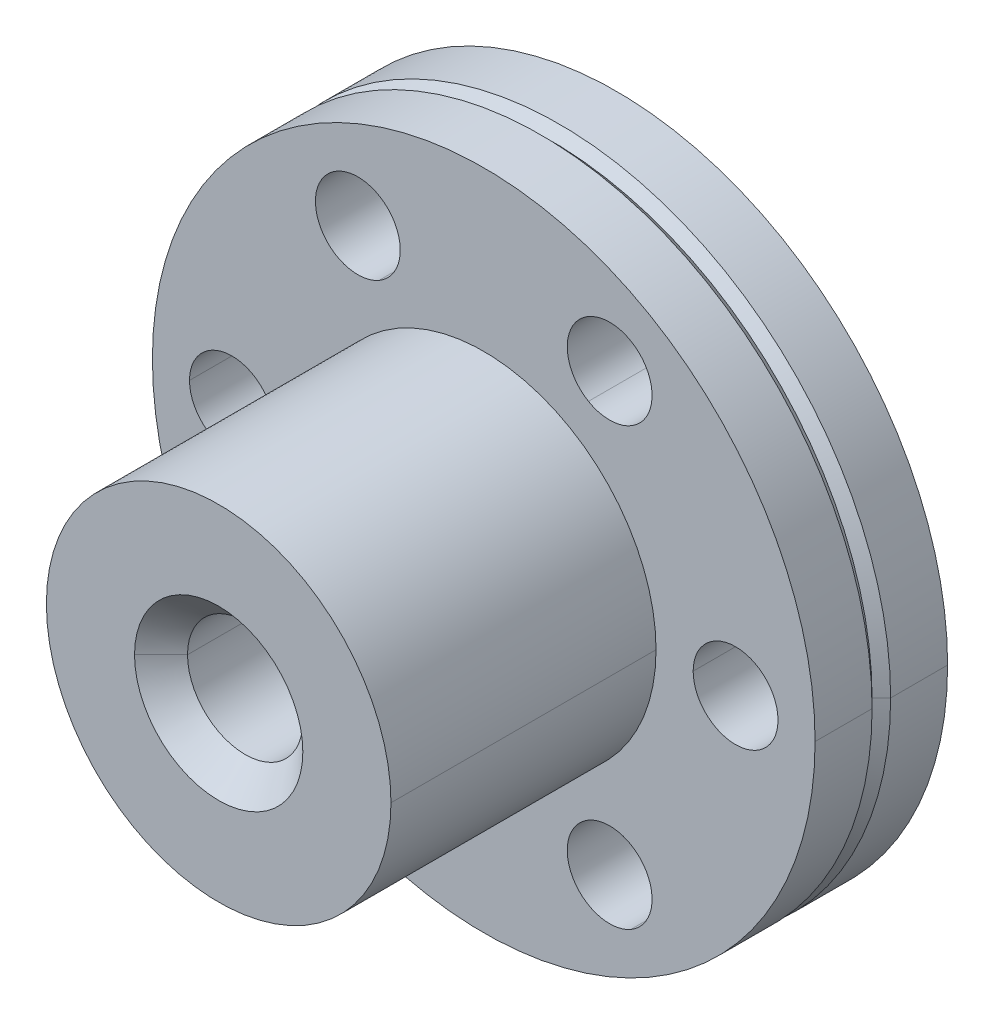
ISO-10303-21;
HEADER;
FILE_DESCRIPTION(('STEP AP214'),'2;1');
FILE_NAME('part.step','',(''),(''),'','','');
FILE_SCHEMA(('AUTOMOTIVE_DESIGN { 1 0 10303 214 1 1 1 1 }'));
ENDSEC;
DATA;
#1=APPLICATION_CONTEXT('core data for automotive mechanical design processes');
#2=APPLICATION_PROTOCOL_DEFINITION('international standard','automotive_design',2000,#1);
#3=PRODUCT_CONTEXT('',#1,'mechanical');
#4=PRODUCT('Part','Part','',(#3));
#5=PRODUCT_RELATED_PRODUCT_CATEGORY('part','',(#4));
#6=PRODUCT_DEFINITION_FORMATION('','',#4);
#7=PRODUCT_DEFINITION_CONTEXT('part definition',#1,'design');
#8=PRODUCT_DEFINITION('design','',#6,#7);
#9=PRODUCT_DEFINITION_SHAPE('','',#8);
#10=(LENGTH_UNIT() NAMED_UNIT(*) SI_UNIT(.MILLI.,.METRE.));
#11=(NAMED_UNIT(*) PLANE_ANGLE_UNIT() SI_UNIT($,.RADIAN.));
#12=(NAMED_UNIT(*) SI_UNIT($,.STERADIAN.) SOLID_ANGLE_UNIT());
#13=UNCERTAINTY_MEASURE_WITH_UNIT(LENGTH_MEASURE(1.E-05),#10,'distance_accuracy_value','');
#14=(GEOMETRIC_REPRESENTATION_CONTEXT(3) GLOBAL_UNCERTAINTY_ASSIGNED_CONTEXT((#13)) GLOBAL_UNIT_ASSIGNED_CONTEXT((#10,
#11,#12)) REPRESENTATION_CONTEXT('',''));
#15=CARTESIAN_POINT('',(0.,0.,0.));
#16=DIRECTION('',(0.,0.,1.));
#17=DIRECTION('',(1.,0.,0.));
#18=AXIS2_PLACEMENT_3D('',#15,#16,#17);
#19=CARTESIAN_POINT('',(0.,0.,0.5));
#20=DIRECTION('',(0.,0.,-1.));
#21=DIRECTION('',(1.,0.,0.));
#22=AXIS2_PLACEMENT_3D('',#19,#20,#21);
#23=CONICAL_SURFACE('',#22,2.675,0.785398163397448);
#24=DIRECTION('',(0.707106781186548,0.,-0.707106781186548));
#25=VECTOR('',#24,1.);
#26=CARTESIAN_POINT('',(2.675,0.,0.5));
#27=LINE('',#26,#25);
#28=CARTESIAN_POINT('',(2.175,0.,1.));
#29=VERTEX_POINT('',#28);
#30=CARTESIAN_POINT('',(3.175,0.,0.));
#31=VERTEX_POINT('',#30);
#32=EDGE_CURVE('E193',#29,#31,#27,.T.);
#33=ORIENTED_EDGE('',*,*,#32,.T.);
#34=CARTESIAN_POINT('',(0.,0.,0.));
#35=DIRECTION('',(0.,0.,-1.));
#36=DIRECTION('',(1.,0.,0.));
#37=AXIS2_PLACEMENT_3D('',#34,#35,#36);
#38=CIRCLE('',#37,3.175);
#39=CARTESIAN_POINT('',(-3.175,0.,0.));
#40=VERTEX_POINT('',#39);
#41=EDGE_CURVE('E9',#31,#40,#38,.T.);
#42=ORIENTED_EDGE('',*,*,#41,.T.);
#43=DIRECTION('',(0.707106781186548,0.,0.707106781186548));
#44=VECTOR('',#43,1.);
#45=CARTESIAN_POINT('',(-2.675,0.,0.5));
#46=LINE('',#45,#44);
#47=CARTESIAN_POINT('',(-2.175,0.,1.));
#48=VERTEX_POINT('',#47);
#49=EDGE_CURVE('E208',#40,#48,#46,.T.);
#50=ORIENTED_EDGE('',*,*,#49,.T.);
#51=CARTESIAN_POINT('',(0.,0.,1.));
#52=DIRECTION('',(0.,0.,-1.));
#53=DIRECTION('',(1.,0.,0.));
#54=AXIS2_PLACEMENT_3D('',#51,#52,#53);
#55=CIRCLE('',#54,2.175);
#56=EDGE_CURVE('E238',#29,#48,#55,.T.);
#57=ORIENTED_EDGE('',*,*,#56,.F.);
#58=EDGE_LOOP('',(#33,#42,#50,#57));
#59=FACE_BOUND('',#58,.T.);
#60=ADVANCED_FACE('F15',(#59),#23,.F.);
#61=CARTESIAN_POINT('',(7.8375,0.,0.));
#62=DIRECTION('',(0.,0.,-1.));
#63=DIRECTION('',(0.,-1.,0.));
#64=AXIS2_PLACEMENT_3D('',#61,#62,#63);
#65=PLANE('',#64);
#66=ORIENTED_EDGE('',*,*,#41,.F.);
#67=CARTESIAN_POINT('',(0.,0.,0.));
#68=DIRECTION('',(0.,0.,-1.));
#69=DIRECTION('',(1.,0.,0.));
#70=AXIS2_PLACEMENT_3D('',#67,#68,#69);
#71=CIRCLE('',#70,3.175);
#72=EDGE_CURVE('E217',#40,#31,#71,.T.);
#73=ORIENTED_EDGE('',*,*,#72,.F.);
#74=EDGE_LOOP('',(#66,#73));
#75=FACE_BOUND('',#74,.T.);
#76=CARTESIAN_POINT('',(9.5,0.,0.));
#77=DIRECTION('',(0.,0.,1.));
#78=DIRECTION('',(1.,0.,0.));
#79=AXIS2_PLACEMENT_3D('',#76,#77,#78);
#80=CIRCLE('',#79,1.6);
#81=CARTESIAN_POINT('',(11.1,0.,0.));
#82=VERTEX_POINT('',#81);
#83=CARTESIAN_POINT('',(7.9,0.,0.));
#84=VERTEX_POINT('',#83);
#85=EDGE_CURVE('E178',#82,#84,#80,.T.);
#86=ORIENTED_EDGE('',*,*,#85,.T.);
#87=CARTESIAN_POINT('',(9.5,0.,0.));
#88=DIRECTION('',(0.,0.,1.));
#89=DIRECTION('',(1.,0.,0.));
#90=AXIS2_PLACEMENT_3D('',#87,#88,#89);
#91=CIRCLE('',#90,1.6);
#92=EDGE_CURVE('E189',#84,#82,#91,.T.);
#93=ORIENTED_EDGE('',*,*,#92,.T.);
#94=EDGE_LOOP('',(#86,#93));
#95=FACE_BOUND('',#94,.T.);
#96=CARTESIAN_POINT('',(4.75,8.227241336,0.));
#97=DIRECTION('',(0.,0.,1.));
#98=DIRECTION('',(0.499999999993262,0.866025403788329,0.));
#99=AXIS2_PLACEMENT_3D('',#96,#97,#98);
#100=CIRCLE('',#99,1.60000000002156);
#101=CARTESIAN_POINT('',(5.55,9.61288198208,0.));
#102=VERTEX_POINT('',#101);
#103=CARTESIAN_POINT('',(3.95,6.84160068992,0.));
#104=VERTEX_POINT('',#103);
#105=EDGE_CURVE('E179',#102,#104,#100,.T.);
#106=ORIENTED_EDGE('',*,*,#105,.T.);
#107=CARTESIAN_POINT('',(4.75,8.227241336,0.));
#108=DIRECTION('',(0.,0.,1.));
#109=DIRECTION('',(0.499999999993262,0.866025403788329,0.));
#110=AXIS2_PLACEMENT_3D('',#107,#108,#109);
#111=CIRCLE('',#110,1.60000000002156);
#112=EDGE_CURVE('E214',#104,#102,#111,.T.);
#113=ORIENTED_EDGE('',*,*,#112,.T.);
#114=EDGE_LOOP('',(#106,#113));
#115=FACE_BOUND('',#114,.T.);
#116=CARTESIAN_POINT('',(-4.75,8.227241336,0.));
#117=DIRECTION('',(0.,0.,1.));
#118=DIRECTION('',(-0.499999999993262,0.866025403788329,0.));
#119=AXIS2_PLACEMENT_3D('',#116,#117,#118);
#120=CIRCLE('',#119,1.60000000002156);
#121=CARTESIAN_POINT('',(-5.55,9.61288198208,0.));
#122=VERTEX_POINT('',#121);
#123=CARTESIAN_POINT('',(-3.95,6.84160068992,0.));
#124=VERTEX_POINT('',#123);
#125=EDGE_CURVE('E227',#122,#124,#120,.T.);
#126=ORIENTED_EDGE('',*,*,#125,.T.);
#127=CARTESIAN_POINT('',(-4.75,8.227241336,0.));
#128=DIRECTION('',(0.,0.,1.));
#129=DIRECTION('',(-0.499999999993262,0.866025403788329,0.));
#130=AXIS2_PLACEMENT_3D('',#127,#128,#129);
#131=CIRCLE('',#130,1.60000000002156);
#132=EDGE_CURVE('E245',#124,#122,#131,.T.);
#133=ORIENTED_EDGE('',*,*,#132,.T.);
#134=EDGE_LOOP('',(#126,#133));
#135=FACE_BOUND('',#134,.T.);
#136=CARTESIAN_POINT('',(-9.5,0.,0.));
#137=DIRECTION('',(0.,0.,1.));
#138=DIRECTION('',(-1.,0.,0.));
#139=AXIS2_PLACEMENT_3D('',#136,#137,#138);
#140=CIRCLE('',#139,1.6);
#141=CARTESIAN_POINT('',(-11.1,0.,0.));
#142=VERTEX_POINT('',#141);
#143=CARTESIAN_POINT('',(-7.9,0.,0.));
#144=VERTEX_POINT('',#143);
#145=EDGE_CURVE('E319',#142,#144,#140,.T.);
#146=ORIENTED_EDGE('',*,*,#145,.T.);
#147=CARTESIAN_POINT('',(-9.5,0.,0.));
#148=DIRECTION('',(0.,0.,1.));
#149=DIRECTION('',(-1.,0.,0.));
#150=AXIS2_PLACEMENT_3D('',#147,#148,#149);
#151=CIRCLE('',#150,1.6);
#152=EDGE_CURVE('E334',#144,#142,#151,.T.);
#153=ORIENTED_EDGE('',*,*,#152,.T.);
#154=EDGE_LOOP('',(#146,#153));
#155=FACE_BOUND('',#154,.T.);
#156=CARTESIAN_POINT('',(-4.75,-8.227241336,0.));
#157=DIRECTION('',(0.,0.,1.));
#158=DIRECTION('',(-0.499999999993262,-0.866025403788329,0.));
#159=AXIS2_PLACEMENT_3D('',#156,#157,#158);
#160=CIRCLE('',#159,1.60000000002156);
#161=CARTESIAN_POINT('',(-5.55,-9.61288198208,0.));
#162=VERTEX_POINT('',#161);
#163=CARTESIAN_POINT('',(-3.95,-6.84160068992,0.));
#164=VERTEX_POINT('',#163);
#165=EDGE_CURVE('E309',#162,#164,#160,.T.);
#166=ORIENTED_EDGE('',*,*,#165,.T.);
#167=CARTESIAN_POINT('',(-4.75,-8.227241336,0.));
#168=DIRECTION('',(0.,0.,1.));
#169=DIRECTION('',(-0.499999999993262,-0.866025403788329,0.));
#170=AXIS2_PLACEMENT_3D('',#167,#168,#169);
#171=CIRCLE('',#170,1.60000000002156);
#172=EDGE_CURVE('E265',#164,#162,#171,.T.);
#173=ORIENTED_EDGE('',*,*,#172,.T.);
#174=EDGE_LOOP('',(#166,#173));
#175=FACE_BOUND('',#174,.T.);
#176=CARTESIAN_POINT('',(4.75,-8.227241336,0.));
#177=DIRECTION('',(0.,0.,1.));
#178=DIRECTION('',(0.499999999993261,-0.866025403788329,0.));
#179=AXIS2_PLACEMENT_3D('',#176,#177,#178);
#180=CIRCLE('',#179,1.60000000002156);
#181=CARTESIAN_POINT('',(5.55,-9.61288198208,0.));
#182=VERTEX_POINT('',#181);
#183=CARTESIAN_POINT('',(3.95,-6.84160068992,0.));
#184=VERTEX_POINT('',#183);
#185=EDGE_CURVE('E36',#182,#184,#180,.T.);
#186=ORIENTED_EDGE('',*,*,#185,.T.);
#187=CARTESIAN_POINT('',(4.75,-8.227241336,0.));
#188=DIRECTION('',(0.,0.,1.));
#189=DIRECTION('',(0.499999999993261,-0.866025403788329,0.));
#190=AXIS2_PLACEMENT_3D('',#187,#188,#189);
#191=CIRCLE('',#190,1.60000000002156);
#192=EDGE_CURVE('E275',#184,#182,#191,.T.);
#193=ORIENTED_EDGE('',*,*,#192,.T.);
#194=EDGE_LOOP('',(#186,#193));
#195=FACE_BOUND('',#194,.T.);
#196=CARTESIAN_POINT('',(0.,0.,0.));
#197=DIRECTION('',(0.,0.,-1.));
#198=DIRECTION('',(1.,0.,0.));
#199=AXIS2_PLACEMENT_3D('',#196,#197,#198);
#200=CIRCLE('',#199,12.5);
#201=CARTESIAN_POINT('',(12.5,0.,0.));
#202=VERTEX_POINT('',#201);
#203=CARTESIAN_POINT('',(-12.5,0.,0.));
#204=VERTEX_POINT('',#203);
#205=EDGE_CURVE('E248',#202,#204,#200,.T.);
#206=ORIENTED_EDGE('',*,*,#205,.T.);
#207=CARTESIAN_POINT('',(0.,0.,0.));
#208=DIRECTION('',(0.,0.,-1.));
#209=DIRECTION('',(1.,0.,0.));
#210=AXIS2_PLACEMENT_3D('',#207,#208,#209);
#211=CIRCLE('',#210,12.5);
#212=EDGE_CURVE('E22',#204,#202,#211,.T.);
#213=ORIENTED_EDGE('',*,*,#212,.T.);
#214=EDGE_LOOP('',(#206,#213));
#215=FACE_BOUND('',#214,.T.);
#216=ADVANCED_FACE('F367',(#75,#95,#115,#135,#155,#175,#195,#215),#65,.T.);
#217=CARTESIAN_POINT('',(0.,0.,1.075));
#218=DIRECTION('',(0.,0.,-1.));
#219=DIRECTION('',(1.,0.,0.));
#220=AXIS2_PLACEMENT_3D('',#217,#218,#219);
#221=CYLINDRICAL_SURFACE('',#220,12.5);
#222=DIRECTION('',(0.,0.,-1.));
#223=VECTOR('',#222,1.);
#224=CARTESIAN_POINT('',(12.5,0.,1.075));
#225=LINE('',#224,#223);
#226=CARTESIAN_POINT('',(12.5,0.,2.15));
#227=VERTEX_POINT('',#226);
#228=EDGE_CURVE('E220',#227,#202,#225,.T.);
#229=ORIENTED_EDGE('',*,*,#228,.T.);
#230=ORIENTED_EDGE('',*,*,#212,.F.);
#231=DIRECTION('',(0.,0.,1.));
#232=VECTOR('',#231,1.);
#233=CARTESIAN_POINT('',(-12.5,0.,1.075));
#234=LINE('',#233,#232);
#235=CARTESIAN_POINT('',(-12.5,0.,2.15));
#236=VERTEX_POINT('',#235);
#237=EDGE_CURVE('E241',#204,#236,#234,.T.);
#238=ORIENTED_EDGE('',*,*,#237,.T.);
#239=CARTESIAN_POINT('',(0.,0.,2.15));
#240=DIRECTION('',(0.,0.,-1.));
#241=DIRECTION('',(1.,0.,0.));
#242=AXIS2_PLACEMENT_3D('',#239,#240,#241);
#243=CIRCLE('',#242,12.5);
#244=EDGE_CURVE('E199',#236,#227,#243,.T.);
#245=ORIENTED_EDGE('',*,*,#244,.T.);
#246=EDGE_LOOP('',(#229,#230,#238,#245));
#247=FACE_BOUND('',#246,.T.);
#248=ADVANCED_FACE('F373',(#247),#221,.T.);
#249=CARTESIAN_POINT('',(0.,0.,2.325));
#250=DIRECTION('',(0.,0.,-1.));
#251=DIRECTION('',(1.,0.,0.));
#252=AXIS2_PLACEMENT_3D('',#249,#250,#251);
#253=CONICAL_SURFACE('',#252,12.325,0.785398163397448);
#254=DIRECTION('',(0.707106781186547,0.,-0.707106781186548));
#255=VECTOR('',#254,1.);
#256=CARTESIAN_POINT('',(12.325,0.,2.325));
#257=LINE('',#256,#255);
#258=CARTESIAN_POINT('',(12.15,0.,2.5));
#259=VERTEX_POINT('',#258);
#260=EDGE_CURVE('E251',#259,#227,#257,.T.);
#261=ORIENTED_EDGE('',*,*,#260,.T.);
#262=ORIENTED_EDGE('',*,*,#244,.F.);
#263=DIRECTION('',(0.707106781186547,0.,0.707106781186548));
#264=VECTOR('',#263,1.);
#265=CARTESIAN_POINT('',(-12.325,0.,2.325));
#266=LINE('',#265,#264);
#267=CARTESIAN_POINT('',(-12.15,0.,2.5));
#268=VERTEX_POINT('',#267);
#269=EDGE_CURVE('E257',#236,#268,#266,.T.);
#270=ORIENTED_EDGE('',*,*,#269,.T.);
#271=CARTESIAN_POINT('',(0.,0.,2.5));
#272=DIRECTION('',(0.,0.,-1.));
#273=DIRECTION('',(1.,0.,0.));
#274=AXIS2_PLACEMENT_3D('',#271,#272,#273);
#275=CIRCLE('',#274,12.15);
#276=EDGE_CURVE('E197',#268,#259,#275,.T.);
#277=ORIENTED_EDGE('',*,*,#276,.T.);
#278=EDGE_LOOP('',(#261,#262,#270,#277));
#279=FACE_BOUND('',#278,.T.);
#280=ADVANCED_FACE('F378',(#279),#253,.T.);
#281=CARTESIAN_POINT('',(0.,0.,2.675));
#282=DIRECTION('',(0.,0.,1.));
#283=DIRECTION('',(1.,0.,0.));
#284=AXIS2_PLACEMENT_3D('',#281,#282,#283);
#285=CONICAL_SURFACE('',#284,12.325,0.785398163397448);
#286=DIRECTION('',(-0.707106781186547,0.,-0.707106781186548));
#287=VECTOR('',#286,1.);
#288=CARTESIAN_POINT('',(12.325,0.,2.675));
#289=LINE('',#288,#287);
#290=CARTESIAN_POINT('',(12.5,0.,2.85));
#291=VERTEX_POINT('',#290);
#292=EDGE_CURVE('E205',#291,#259,#289,.T.);
#293=ORIENTED_EDGE('',*,*,#292,.T.);
#294=ORIENTED_EDGE('',*,*,#276,.F.);
#295=DIRECTION('',(-0.707106781186547,0.,0.707106781186548));
#296=VECTOR('',#295,1.);
#297=CARTESIAN_POINT('',(-12.325,0.,2.675));
#298=LINE('',#297,#296);
#299=CARTESIAN_POINT('',(-12.5,0.,2.85));
#300=VERTEX_POINT('',#299);
#301=EDGE_CURVE('E204',#268,#300,#298,.T.);
#302=ORIENTED_EDGE('',*,*,#301,.T.);
#303=CARTESIAN_POINT('',(0.,0.,2.85));
#304=DIRECTION('',(0.,0.,-1.));
#305=DIRECTION('',(1.,0.,0.));
#306=AXIS2_PLACEMENT_3D('',#303,#304,#305);
#307=CIRCLE('',#306,12.5);
#308=EDGE_CURVE('E200',#300,#291,#307,.T.);
#309=ORIENTED_EDGE('',*,*,#308,.T.);
#310=EDGE_LOOP('',(#293,#294,#302,#309));
#311=FACE_BOUND('',#310,.T.);
#312=ADVANCED_FACE('F388',(#311),#285,.T.);
#313=CARTESIAN_POINT('',(0.,0.,3.925));
#314=DIRECTION('',(0.,0.,-1.));
#315=DIRECTION('',(1.,0.,0.));
#316=AXIS2_PLACEMENT_3D('',#313,#314,#315);
#317=CYLINDRICAL_SURFACE('',#316,12.5);
#318=DIRECTION('',(0.,0.,-1.));
#319=VECTOR('',#318,1.);
#320=CARTESIAN_POINT('',(12.5,0.,3.925));
#321=LINE('',#320,#319);
#322=CARTESIAN_POINT('',(12.5,0.,5.));
#323=VERTEX_POINT('',#322);
#324=EDGE_CURVE('E211',#323,#291,#321,.T.);
#325=ORIENTED_EDGE('',*,*,#324,.T.);
#326=ORIENTED_EDGE('',*,*,#308,.F.);
#327=DIRECTION('',(0.,0.,1.));
#328=VECTOR('',#327,1.);
#329=CARTESIAN_POINT('',(-12.5,0.,3.925));
#330=LINE('',#329,#328);
#331=CARTESIAN_POINT('',(-12.5,0.,5.));
#332=VERTEX_POINT('',#331);
#333=EDGE_CURVE('E224',#300,#332,#330,.T.);
#334=ORIENTED_EDGE('',*,*,#333,.T.);
#335=CARTESIAN_POINT('',(0.,0.,5.));
#336=DIRECTION('',(0.,0.,-1.));
#337=DIRECTION('',(1.,0.,0.));
#338=AXIS2_PLACEMENT_3D('',#335,#336,#337);
#339=CIRCLE('',#338,12.5);
#340=EDGE_CURVE('E362',#332,#323,#339,.T.);
#341=ORIENTED_EDGE('',*,*,#340,.T.);
#342=EDGE_LOOP('',(#325,#326,#334,#341));
#343=FACE_BOUND('',#342,.T.);
#344=ADVANCED_FACE('F392',(#343),#317,.T.);
#345=CARTESIAN_POINT('',(9.5,0.,5.));
#346=DIRECTION('',(0.,0.,1.));
#347=DIRECTION('',(0.,-1.,0.));
#348=AXIS2_PLACEMENT_3D('',#345,#346,#347);
#349=PLANE('',#348);
#350=CARTESIAN_POINT('',(0.,0.,5.));
#351=DIRECTION('',(0.,0.,-1.));
#352=DIRECTION('',(1.,0.,0.));
#353=AXIS2_PLACEMENT_3D('',#350,#351,#352);
#354=CIRCLE('',#353,6.5);
#355=CARTESIAN_POINT('',(6.5,0.,5.));
#356=VERTEX_POINT('',#355);
#357=CARTESIAN_POINT('',(-6.5,0.,5.));
#358=VERTEX_POINT('',#357);
#359=EDGE_CURVE('E284',#356,#358,#354,.T.);
#360=ORIENTED_EDGE('',*,*,#359,.T.);
#361=CARTESIAN_POINT('',(0.,0.,5.));
#362=DIRECTION('',(0.,0.,-1.));
#363=DIRECTION('',(1.,0.,0.));
#364=AXIS2_PLACEMENT_3D('',#361,#362,#363);
#365=CIRCLE('',#364,6.5);
#366=EDGE_CURVE('E360',#358,#356,#365,.T.);
#367=ORIENTED_EDGE('',*,*,#366,.T.);
#368=EDGE_LOOP('',(#360,#367));
#369=FACE_BOUND('',#368,.T.);
#370=CARTESIAN_POINT('',(9.5,0.,5.));
#371=DIRECTION('',(0.,0.,-1.));
#372=DIRECTION('',(1.,0.,0.));
#373=AXIS2_PLACEMENT_3D('',#370,#371,#372);
#374=CIRCLE('',#373,1.6);
#375=CARTESIAN_POINT('',(11.1,0.,5.));
#376=VERTEX_POINT('',#375);
#377=CARTESIAN_POINT('',(7.9,0.,5.));
#378=VERTEX_POINT('',#377);
#379=EDGE_CURVE('E181',#376,#378,#374,.T.);
#380=ORIENTED_EDGE('',*,*,#379,.T.);
#381=CARTESIAN_POINT('',(9.5,0.,5.));
#382=DIRECTION('',(0.,0.,-1.));
#383=DIRECTION('',(1.,0.,0.));
#384=AXIS2_PLACEMENT_3D('',#381,#382,#383);
#385=CIRCLE('',#384,1.6);
#386=EDGE_CURVE('E168',#378,#376,#385,.T.);
#387=ORIENTED_EDGE('',*,*,#386,.T.);
#388=EDGE_LOOP('',(#380,#387));
#389=FACE_BOUND('',#388,.T.);
#390=CARTESIAN_POINT('',(4.75,8.227241336,5.));
#391=DIRECTION('',(0.,0.,-1.));
#392=DIRECTION('',(0.499999999993262,0.866025403788329,0.));
#393=AXIS2_PLACEMENT_3D('',#390,#391,#392);
#394=CIRCLE('',#393,1.60000000002156);
#395=CARTESIAN_POINT('',(5.55,9.61288198208,5.00000000006738));
#396=VERTEX_POINT('',#395);
#397=CARTESIAN_POINT('',(3.95,6.84160068992,5.));
#398=VERTEX_POINT('',#397);
#399=EDGE_CURVE('E231',#396,#398,#394,.T.);
#400=ORIENTED_EDGE('',*,*,#399,.T.);
#401=CARTESIAN_POINT('',(4.75,8.227241336,5.));
#402=DIRECTION('',(0.,0.,-1.));
#403=DIRECTION('',(0.499999999993262,0.866025403788329,0.));
#404=AXIS2_PLACEMENT_3D('',#401,#402,#403);
#405=CIRCLE('',#404,1.60000000002156);
#406=EDGE_CURVE('E225',#398,#396,#405,.T.);
#407=ORIENTED_EDGE('',*,*,#406,.T.);
#408=EDGE_LOOP('',(#400,#407));
#409=FACE_BOUND('',#408,.T.);
#410=CARTESIAN_POINT('',(-4.75,8.227241336,5.));
#411=DIRECTION('',(0.,0.,-1.));
#412=DIRECTION('',(-0.499999999993262,0.866025403788329,0.));
#413=AXIS2_PLACEMENT_3D('',#410,#411,#412);
#414=CIRCLE('',#413,1.60000000002156);
#415=CARTESIAN_POINT('',(-5.55,9.61288198208,5.00000000006738));
#416=VERTEX_POINT('',#415);
#417=CARTESIAN_POINT('',(-3.95,6.84160068992,5.));
#418=VERTEX_POINT('',#417);
#419=EDGE_CURVE('E294',#416,#418,#414,.T.);
#420=ORIENTED_EDGE('',*,*,#419,.T.);
#421=CARTESIAN_POINT('',(-4.75,8.227241336,5.));
#422=DIRECTION('',(0.,0.,-1.));
#423=DIRECTION('',(-0.499999999993262,0.866025403788329,0.));
#424=AXIS2_PLACEMENT_3D('',#421,#422,#423);
#425=CIRCLE('',#424,1.60000000002156);
#426=EDGE_CURVE('E321',#418,#416,#425,.T.);
#427=ORIENTED_EDGE('',*,*,#426,.T.);
#428=EDGE_LOOP('',(#420,#427));
#429=FACE_BOUND('',#428,.T.);
#430=CARTESIAN_POINT('',(-9.5,0.,5.));
#431=DIRECTION('',(0.,0.,-1.));
#432=DIRECTION('',(-1.,0.,0.));
#433=AXIS2_PLACEMENT_3D('',#430,#431,#432);
#434=CIRCLE('',#433,1.6);
#435=CARTESIAN_POINT('',(-11.1,0.,5.));
#436=VERTEX_POINT('',#435);
#437=CARTESIAN_POINT('',(-7.9,0.,5.));
#438=VERTEX_POINT('',#437);
#439=EDGE_CURVE('E266',#436,#438,#434,.T.);
#440=ORIENTED_EDGE('',*,*,#439,.T.);
#441=CARTESIAN_POINT('',(-9.5,0.,5.));
#442=DIRECTION('',(0.,0.,-1.));
#443=DIRECTION('',(-1.,0.,0.));
#444=AXIS2_PLACEMENT_3D('',#441,#442,#443);
#445=CIRCLE('',#444,1.6);
#446=EDGE_CURVE('E311',#438,#436,#445,.T.);
#447=ORIENTED_EDGE('',*,*,#446,.T.);
#448=EDGE_LOOP('',(#440,#447));
#449=FACE_BOUND('',#448,.T.);
#450=CARTESIAN_POINT('',(-4.75,-8.227241336,5.));
#451=DIRECTION('',(0.,0.,-1.));
#452=DIRECTION('',(-0.499999999993262,-0.866025403788329,0.));
#453=AXIS2_PLACEMENT_3D('',#450,#451,#452);
#454=CIRCLE('',#453,1.60000000002156);
#455=CARTESIAN_POINT('',(-5.55,-9.61288198208,5.00000000006738));
#456=VERTEX_POINT('',#455);
#457=CARTESIAN_POINT('',(-3.95,-6.84160068992,5.));
#458=VERTEX_POINT('',#457);
#459=EDGE_CURVE('E287',#456,#458,#454,.T.);
#460=ORIENTED_EDGE('',*,*,#459,.T.);
#461=CARTESIAN_POINT('',(-4.75,-8.227241336,5.));
#462=DIRECTION('',(0.,0.,-1.));
#463=DIRECTION('',(-0.499999999993262,-0.866025403788329,0.));
#464=AXIS2_PLACEMENT_3D('',#461,#462,#463);
#465=CIRCLE('',#464,1.60000000002156);
#466=EDGE_CURVE('E312',#458,#456,#465,.T.);
#467=ORIENTED_EDGE('',*,*,#466,.T.);
#468=EDGE_LOOP('',(#460,#467));
#469=FACE_BOUND('',#468,.T.);
#470=CARTESIAN_POINT('',(4.75,-8.227241336,5.));
#471=DIRECTION('',(0.,0.,-1.));
#472=DIRECTION('',(0.499999999993261,-0.866025403788329,0.));
#473=AXIS2_PLACEMENT_3D('',#470,#471,#472);
#474=CIRCLE('',#473,1.60000000002156);
#475=CARTESIAN_POINT('',(5.55,-9.61288198208,5.00000000006738));
#476=VERTEX_POINT('',#475);
#477=CARTESIAN_POINT('',(3.95,-6.84160068992,5.));
#478=VERTEX_POINT('',#477);
#479=EDGE_CURVE('E274',#476,#478,#474,.T.);
#480=ORIENTED_EDGE('',*,*,#479,.T.);
#481=CARTESIAN_POINT('',(4.75,-8.227241336,5.));
#482=DIRECTION('',(0.,0.,-1.));
#483=DIRECTION('',(0.499999999993261,-0.866025403788329,0.));
#484=AXIS2_PLACEMENT_3D('',#481,#482,#483);
#485=CIRCLE('',#484,1.60000000002156);
#486=EDGE_CURVE('E29',#478,#476,#485,.T.);
#487=ORIENTED_EDGE('',*,*,#486,.T.);
#488=EDGE_LOOP('',(#480,#487));
#489=FACE_BOUND('',#488,.T.);
#490=CARTESIAN_POINT('',(0.,0.,5.));
#491=DIRECTION('',(0.,0.,-1.));
#492=DIRECTION('',(1.,0.,0.));
#493=AXIS2_PLACEMENT_3D('',#490,#491,#492);
#494=CIRCLE('',#493,12.5);
#495=EDGE_CURVE('E221',#323,#332,#494,.T.);
#496=ORIENTED_EDGE('',*,*,#495,.F.);
#497=ORIENTED_EDGE('',*,*,#340,.F.);
#498=EDGE_LOOP('',(#496,#497));
#499=FACE_BOUND('',#498,.T.);
#500=ADVANCED_FACE('F182',(#369,#389,#409,#429,#449,#469,#489,#499),#349,.T.);
#501=CARTESIAN_POINT('',(0.,0.,10.));
#502=DIRECTION('',(0.,0.,-1.));
#503=DIRECTION('',(1.,0.,0.));
#504=AXIS2_PLACEMENT_3D('',#501,#502,#503);
#505=CYLINDRICAL_SURFACE('',#504,6.5);
#506=DIRECTION('',(0.,0.,-1.));
#507=VECTOR('',#506,1.);
#508=CARTESIAN_POINT('',(6.5,0.,10.));
#509=LINE('',#508,#507);
#510=CARTESIAN_POINT('',(6.5,0.,15.));
#511=VERTEX_POINT('',#510);
#512=EDGE_CURVE('E271',#511,#356,#509,.T.);
#513=ORIENTED_EDGE('',*,*,#512,.T.);
#514=ORIENTED_EDGE('',*,*,#366,.F.);
#515=DIRECTION('',(0.,0.,1.));
#516=VECTOR('',#515,1.);
#517=CARTESIAN_POINT('',(-6.5,0.,10.));
#518=LINE('',#517,#516);
#519=CARTESIAN_POINT('',(-6.5,0.,15.));
#520=VERTEX_POINT('',#519);
#521=EDGE_CURVE('E281',#358,#520,#518,.T.);
#522=ORIENTED_EDGE('',*,*,#521,.T.);
#523=CARTESIAN_POINT('',(0.,0.,15.));
#524=DIRECTION('',(0.,0.,-1.));
#525=DIRECTION('',(1.,0.,0.));
#526=AXIS2_PLACEMENT_3D('',#523,#524,#525);
#527=CIRCLE('',#526,6.5);
#528=EDGE_CURVE('E305',#520,#511,#527,.T.);
#529=ORIENTED_EDGE('',*,*,#528,.T.);
#530=EDGE_LOOP('',(#513,#514,#522,#529));
#531=FACE_BOUND('',#530,.T.);
#532=ADVANCED_FACE('F398',(#531),#505,.T.);
#533=CARTESIAN_POINT('',(4.8375,0.,15.));
#534=DIRECTION('',(0.,0.,1.));
#535=DIRECTION('',(0.,-1.,0.));
#536=AXIS2_PLACEMENT_3D('',#533,#534,#535);
#537=PLANE('',#536);
#538=CARTESIAN_POINT('',(0.,0.,15.));
#539=DIRECTION('',(0.,0.,-1.));
#540=DIRECTION('',(1.,0.,0.));
#541=AXIS2_PLACEMENT_3D('',#538,#539,#540);
#542=CIRCLE('',#541,3.175);
#543=CARTESIAN_POINT('',(3.175,0.,15.));
#544=VERTEX_POINT('',#543);
#545=CARTESIAN_POINT('',(-3.175,0.,15.));
#546=VERTEX_POINT('',#545);
#547=EDGE_CURVE('E237',#544,#546,#542,.T.);
#548=ORIENTED_EDGE('',*,*,#547,.T.);
#549=CARTESIAN_POINT('',(0.,0.,15.));
#550=DIRECTION('',(0.,0.,-1.));
#551=DIRECTION('',(1.,0.,0.));
#552=AXIS2_PLACEMENT_3D('',#549,#550,#551);
#553=CIRCLE('',#552,3.175);
#554=EDGE_CURVE('E297',#546,#544,#553,.T.);
#555=ORIENTED_EDGE('',*,*,#554,.T.);
#556=EDGE_LOOP('',(#548,#555));
#557=FACE_BOUND('',#556,.T.);
#558=CARTESIAN_POINT('',(0.,0.,15.));
#559=DIRECTION('',(0.,0.,-1.));
#560=DIRECTION('',(1.,0.,0.));
#561=AXIS2_PLACEMENT_3D('',#558,#559,#560);
#562=CIRCLE('',#561,6.5);
#563=EDGE_CURVE('E278',#511,#520,#562,.T.);
#564=ORIENTED_EDGE('',*,*,#563,.F.);
#565=ORIENTED_EDGE('',*,*,#528,.F.);
#566=EDGE_LOOP('',(#564,#565));
#567=FACE_BOUND('',#566,.T.);
#568=ADVANCED_FACE('F406',(#557,#567),#537,.T.);
#569=CARTESIAN_POINT('',(0.,0.,14.5));
#570=DIRECTION('',(0.,0.,1.));
#571=DIRECTION('',(1.,0.,0.));
#572=AXIS2_PLACEMENT_3D('',#569,#570,#571);
#573=CONICAL_SURFACE('',#572,2.675,0.785398163397448);
#574=DIRECTION('',(-0.707106781186548,0.,-0.707106781186548));
#575=VECTOR('',#574,1.);
#576=CARTESIAN_POINT('',(2.675,0.,14.5));
#577=LINE('',#576,#575);
#578=CARTESIAN_POINT('',(2.175,0.,14.));
#579=VERTEX_POINT('',#578);
#580=EDGE_CURVE('E290',#544,#579,#577,.T.);
#581=ORIENTED_EDGE('',*,*,#580,.T.);
#582=CARTESIAN_POINT('',(0.,0.,14.));
#583=DIRECTION('',(0.,0.,-1.));
#584=DIRECTION('',(1.,0.,0.));
#585=AXIS2_PLACEMENT_3D('',#582,#583,#584);
#586=CIRCLE('',#585,2.175);
#587=CARTESIAN_POINT('',(-2.175,0.,14.));
#588=VERTEX_POINT('',#587);
#589=EDGE_CURVE('E235',#579,#588,#586,.T.);
#590=ORIENTED_EDGE('',*,*,#589,.T.);
#591=DIRECTION('',(-0.707106781186548,0.,0.707106781186548));
#592=VECTOR('',#591,1.);
#593=CARTESIAN_POINT('',(-2.675,0.,14.5));
#594=LINE('',#593,#592);
#595=EDGE_CURVE('E300',#588,#546,#594,.T.);
#596=ORIENTED_EDGE('',*,*,#595,.T.);
#597=ORIENTED_EDGE('',*,*,#547,.F.);
#598=EDGE_LOOP('',(#581,#590,#596,#597));
#599=FACE_BOUND('',#598,.T.);
#600=ADVANCED_FACE('F472',(#599),#573,.F.);
#601=CARTESIAN_POINT('',(0.,0.,7.5));
#602=DIRECTION('',(0.,0.,-1.));
#603=DIRECTION('',(1.,0.,0.));
#604=AXIS2_PLACEMENT_3D('',#601,#602,#603);
#605=CYLINDRICAL_SURFACE('',#604,2.175);
#606=DIRECTION('',(0.,0.,-1.));
#607=VECTOR('',#606,1.);
#608=CARTESIAN_POINT('',(2.175,0.,7.5));
#609=LINE('',#608,#607);
#610=EDGE_CURVE('E308',#579,#29,#609,.T.);
#611=ORIENTED_EDGE('',*,*,#610,.T.);
#612=ORIENTED_EDGE('',*,*,#56,.T.);
#613=DIRECTION('',(0.,0.,1.));
#614=VECTOR('',#613,1.);
#615=CARTESIAN_POINT('',(-2.175,0.,7.5));
#616=LINE('',#615,#614);
#617=EDGE_CURVE('E315',#48,#588,#616,.T.);
#618=ORIENTED_EDGE('',*,*,#617,.T.);
#619=ORIENTED_EDGE('',*,*,#589,.F.);
#620=EDGE_LOOP('',(#611,#612,#618,#619));
#621=FACE_BOUND('',#620,.T.);
#622=ADVANCED_FACE('F469',(#621),#605,.F.);
#623=CARTESIAN_POINT('',(9.5,0.,2.5));
#624=DIRECTION('',(0.,0.,-1.));
#625=DIRECTION('',(1.,0.,0.));
#626=AXIS2_PLACEMENT_3D('',#623,#624,#625);
#627=CYLINDRICAL_SURFACE('',#626,1.6);
#628=DIRECTION('',(0.,0.,1.));
#629=VECTOR('',#628,1.);
#630=CARTESIAN_POINT('',(11.1,0.,2.5));
#631=LINE('',#630,#629);
#632=EDGE_CURVE('E175',#82,#376,#631,.T.);
#633=ORIENTED_EDGE('',*,*,#632,.T.);
#634=ORIENTED_EDGE('',*,*,#386,.F.);
#635=DIRECTION('',(0.,0.,-1.));
#636=VECTOR('',#635,1.);
#637=CARTESIAN_POINT('',(7.9,0.,2.5));
#638=LINE('',#637,#636);
#639=EDGE_CURVE('E172',#378,#84,#638,.T.);
#640=ORIENTED_EDGE('',*,*,#639,.T.);
#641=ORIENTED_EDGE('',*,*,#85,.F.);
#642=EDGE_LOOP('',(#633,#634,#640,#641));
#643=FACE_BOUND('',#642,.T.);
#644=ADVANCED_FACE('F170',(#643),#627,.F.);
#645=CARTESIAN_POINT('',(4.75,8.227241336,2.50000000003369));
#646=DIRECTION('',(0.,0.,-1.));
#647=DIRECTION('',(0.499999999993262,0.866025403788329,0.));
#648=AXIS2_PLACEMENT_3D('',#645,#646,#647);
#649=CYLINDRICAL_SURFACE('',#648,1.60000000002156);
#650=DIRECTION('',(0.,0.,1.));
#651=VECTOR('',#650,1.);
#652=CARTESIAN_POINT('',(5.55,9.61288198208,2.50000000003369));
#653=LINE('',#652,#651);
#654=EDGE_CURVE('E185',#102,#396,#653,.T.);
#655=ORIENTED_EDGE('',*,*,#654,.T.);
#656=ORIENTED_EDGE('',*,*,#406,.F.);
#657=DIRECTION('',(0.,0.,-1.));
#658=VECTOR('',#657,1.);
#659=CARTESIAN_POINT('',(3.95,6.84160068992,2.50000000003369));
#660=LINE('',#659,#658);
#661=EDGE_CURVE('E228',#398,#104,#660,.T.);
#662=ORIENTED_EDGE('',*,*,#661,.T.);
#663=ORIENTED_EDGE('',*,*,#105,.F.);
#664=EDGE_LOOP('',(#655,#656,#662,#663));
#665=FACE_BOUND('',#664,.T.);
#666=ADVANCED_FACE('F462',(#665),#649,.F.);
#667=CARTESIAN_POINT('',(-4.75,8.227241336,2.50000000003369));
#668=DIRECTION('',(0.,0.,-1.));
#669=DIRECTION('',(-0.499999999993262,0.866025403788329,0.));
#670=AXIS2_PLACEMENT_3D('',#667,#668,#669);
#671=CYLINDRICAL_SURFACE('',#670,1.60000000002156);
#672=DIRECTION('',(0.,0.,1.));
#673=VECTOR('',#672,1.);
#674=CARTESIAN_POINT('',(-5.55,9.61288198208,2.50000000003369));
#675=LINE('',#674,#673);
#676=EDGE_CURVE('E242',#122,#416,#675,.T.);
#677=ORIENTED_EDGE('',*,*,#676,.T.);
#678=ORIENTED_EDGE('',*,*,#426,.F.);
#679=DIRECTION('',(0.,0.,-1.));
#680=VECTOR('',#679,1.);
#681=CARTESIAN_POINT('',(-3.95,6.84160068992,2.50000000003369));
#682=LINE('',#681,#680);
#683=EDGE_CURVE('E291',#418,#124,#682,.T.);
#684=ORIENTED_EDGE('',*,*,#683,.T.);
#685=ORIENTED_EDGE('',*,*,#125,.F.);
#686=EDGE_LOOP('',(#677,#678,#684,#685));
#687=FACE_BOUND('',#686,.T.);
#688=ADVANCED_FACE('F458',(#687),#671,.F.);
#689=CARTESIAN_POINT('',(-9.5,0.,2.5));
#690=DIRECTION('',(0.,0.,-1.));
#691=DIRECTION('',(-1.,0.,0.));
#692=AXIS2_PLACEMENT_3D('',#689,#690,#691);
#693=CYLINDRICAL_SURFACE('',#692,1.6);
#694=DIRECTION('',(0.,0.,1.));
#695=VECTOR('',#694,1.);
#696=CARTESIAN_POINT('',(-11.1,0.,2.5));
#697=LINE('',#696,#695);
#698=EDGE_CURVE('E331',#142,#436,#697,.T.);
#699=ORIENTED_EDGE('',*,*,#698,.T.);
#700=ORIENTED_EDGE('',*,*,#446,.F.);
#701=DIRECTION('',(0.,0.,-1.));
#702=VECTOR('',#701,1.);
#703=CARTESIAN_POINT('',(-7.9,0.,2.5));
#704=LINE('',#703,#702);
#705=EDGE_CURVE('E337',#438,#144,#704,.T.);
#706=ORIENTED_EDGE('',*,*,#705,.T.);
#707=ORIENTED_EDGE('',*,*,#145,.F.);
#708=EDGE_LOOP('',(#699,#700,#706,#707));
#709=FACE_BOUND('',#708,.T.);
#710=ADVANCED_FACE('F451',(#709),#693,.F.);
#711=CARTESIAN_POINT('',(-4.75,-8.227241336,2.50000000003369));
#712=DIRECTION('',(0.,0.,-1.));
#713=DIRECTION('',(-0.499999999993262,-0.866025403788329,0.));
#714=AXIS2_PLACEMENT_3D('',#711,#712,#713);
#715=CYLINDRICAL_SURFACE('',#714,1.60000000002156);
#716=DIRECTION('',(0.,0.,1.));
#717=VECTOR('',#716,1.);
#718=CARTESIAN_POINT('',(-5.55,-9.61288198208,2.50000000003369));
#719=LINE('',#718,#717);
#720=EDGE_CURVE('E262',#162,#456,#719,.T.);
#721=ORIENTED_EDGE('',*,*,#720,.T.);
#722=ORIENTED_EDGE('',*,*,#466,.F.);
#723=DIRECTION('',(0.,0.,-1.));
#724=VECTOR('',#723,1.);
#725=CARTESIAN_POINT('',(-3.95,-6.84160068992,2.50000000003369));
#726=LINE('',#725,#724);
#727=EDGE_CURVE('E344',#458,#164,#726,.T.);
#728=ORIENTED_EDGE('',*,*,#727,.T.);
#729=ORIENTED_EDGE('',*,*,#165,.F.);
#730=EDGE_LOOP('',(#721,#722,#728,#729));
#731=FACE_BOUND('',#730,.T.);
#732=ADVANCED_FACE('F431',(#731),#715,.F.);
#733=CARTESIAN_POINT('',(4.75,-8.227241336,2.50000000003369));
#734=DIRECTION('',(0.,0.,-1.));
#735=DIRECTION('',(0.499999999993261,-0.866025403788329,0.));
#736=AXIS2_PLACEMENT_3D('',#733,#734,#735);
#737=CYLINDRICAL_SURFACE('',#736,1.60000000002156);
#738=DIRECTION('',(0.,0.,1.));
#739=VECTOR('',#738,1.);
#740=CARTESIAN_POINT('',(5.55,-9.61288198208,2.50000000003369));
#741=LINE('',#740,#739);
#742=EDGE_CURVE('E285',#182,#476,#741,.T.);
#743=ORIENTED_EDGE('',*,*,#742,.T.);
#744=ORIENTED_EDGE('',*,*,#486,.F.);
#745=DIRECTION('',(0.,0.,-1.));
#746=VECTOR('',#745,1.);
#747=CARTESIAN_POINT('',(3.95,-6.84160068992,2.50000000003369));
#748=LINE('',#747,#746);
#749=EDGE_CURVE('E272',#478,#184,#748,.T.);
#750=ORIENTED_EDGE('',*,*,#749,.T.);
#751=ORIENTED_EDGE('',*,*,#185,.F.);
#752=EDGE_LOOP('',(#743,#744,#750,#751));
#753=FACE_BOUND('',#752,.T.);
#754=ADVANCED_FACE('F443',(#753),#737,.F.);
#755=CARTESIAN_POINT('',(4.75,-8.227241336,2.50000000003369));
#756=DIRECTION('',(0.,0.,-1.));
#757=DIRECTION('',(0.499999999993261,-0.866025403788329,0.));
#758=AXIS2_PLACEMENT_3D('',#755,#756,#757);
#759=CYLINDRICAL_SURFACE('',#758,1.60000000002156);
#760=ORIENTED_EDGE('',*,*,#742,.F.);
#761=ORIENTED_EDGE('',*,*,#192,.F.);
#762=ORIENTED_EDGE('',*,*,#749,.F.);
#763=ORIENTED_EDGE('',*,*,#479,.F.);
#764=EDGE_LOOP('',(#760,#761,#762,#763));
#765=FACE_BOUND('',#764,.T.);
#766=ADVANCED_FACE('F442',(#765),#759,.F.);
#767=CARTESIAN_POINT('',(-4.75,-8.227241336,2.50000000003369));
#768=DIRECTION('',(0.,0.,-1.));
#769=DIRECTION('',(-0.499999999993262,-0.866025403788329,0.));
#770=AXIS2_PLACEMENT_3D('',#767,#768,#769);
#771=CYLINDRICAL_SURFACE('',#770,1.60000000002156);
#772=ORIENTED_EDGE('',*,*,#720,.F.);
#773=ORIENTED_EDGE('',*,*,#172,.F.);
#774=ORIENTED_EDGE('',*,*,#727,.F.);
#775=ORIENTED_EDGE('',*,*,#459,.F.);
#776=EDGE_LOOP('',(#772,#773,#774,#775));
#777=FACE_BOUND('',#776,.T.);
#778=ADVANCED_FACE('F434',(#777),#771,.F.);
#779=CARTESIAN_POINT('',(-9.5,0.,2.5));
#780=DIRECTION('',(0.,0.,-1.));
#781=DIRECTION('',(-1.,0.,0.));
#782=AXIS2_PLACEMENT_3D('',#779,#780,#781);
#783=CYLINDRICAL_SURFACE('',#782,1.6);
#784=ORIENTED_EDGE('',*,*,#698,.F.);
#785=ORIENTED_EDGE('',*,*,#152,.F.);
#786=ORIENTED_EDGE('',*,*,#705,.F.);
#787=ORIENTED_EDGE('',*,*,#439,.F.);
#788=EDGE_LOOP('',(#784,#785,#786,#787));
#789=FACE_BOUND('',#788,.T.);
#790=ADVANCED_FACE('F512',(#789),#783,.F.);
#791=CARTESIAN_POINT('',(-4.75,8.227241336,2.50000000003369));
#792=DIRECTION('',(0.,0.,-1.));
#793=DIRECTION('',(-0.499999999993262,0.866025403788329,0.));
#794=AXIS2_PLACEMENT_3D('',#791,#792,#793);
#795=CYLINDRICAL_SURFACE('',#794,1.60000000002156);
#796=ORIENTED_EDGE('',*,*,#676,.F.);
#797=ORIENTED_EDGE('',*,*,#132,.F.);
#798=ORIENTED_EDGE('',*,*,#683,.F.);
#799=ORIENTED_EDGE('',*,*,#419,.F.);
#800=EDGE_LOOP('',(#796,#797,#798,#799));
#801=FACE_BOUND('',#800,.T.);
#802=ADVANCED_FACE('F500',(#801),#795,.F.);
#803=CARTESIAN_POINT('',(4.75,8.227241336,2.50000000003369));
#804=DIRECTION('',(0.,0.,-1.));
#805=DIRECTION('',(0.499999999993262,0.866025403788329,0.));
#806=AXIS2_PLACEMENT_3D('',#803,#804,#805);
#807=CYLINDRICAL_SURFACE('',#806,1.60000000002156);
#808=ORIENTED_EDGE('',*,*,#654,.F.);
#809=ORIENTED_EDGE('',*,*,#112,.F.);
#810=ORIENTED_EDGE('',*,*,#661,.F.);
#811=ORIENTED_EDGE('',*,*,#399,.F.);
#812=EDGE_LOOP('',(#808,#809,#810,#811));
#813=FACE_BOUND('',#812,.T.);
#814=ADVANCED_FACE('F506',(#813),#807,.F.);
#815=CARTESIAN_POINT('',(9.5,0.,2.5));
#816=DIRECTION('',(0.,0.,-1.));
#817=DIRECTION('',(1.,0.,0.));
#818=AXIS2_PLACEMENT_3D('',#815,#816,#817);
#819=CYLINDRICAL_SURFACE('',#818,1.6);
#820=ORIENTED_EDGE('',*,*,#632,.F.);
#821=ORIENTED_EDGE('',*,*,#92,.F.);
#822=ORIENTED_EDGE('',*,*,#639,.F.);
#823=ORIENTED_EDGE('',*,*,#379,.F.);
#824=EDGE_LOOP('',(#820,#821,#822,#823));
#825=FACE_BOUND('',#824,.T.);
#826=ADVANCED_FACE('F187',(#825),#819,.F.);
#827=CARTESIAN_POINT('',(0.,0.,7.5));
#828=DIRECTION('',(0.,0.,-1.));
#829=DIRECTION('',(1.,0.,0.));
#830=AXIS2_PLACEMENT_3D('',#827,#828,#829);
#831=CYLINDRICAL_SURFACE('',#830,2.175);
#832=ORIENTED_EDGE('',*,*,#610,.F.);
#833=CARTESIAN_POINT('',(0.,0.,14.));
#834=DIRECTION('',(0.,0.,-1.));
#835=DIRECTION('',(1.,0.,0.));
#836=AXIS2_PLACEMENT_3D('',#833,#834,#835);
#837=CIRCLE('',#836,2.175);
#838=EDGE_CURVE('E303',#588,#579,#837,.T.);
#839=ORIENTED_EDGE('',*,*,#838,.F.);
#840=ORIENTED_EDGE('',*,*,#617,.F.);
#841=CARTESIAN_POINT('',(0.,0.,1.));
#842=DIRECTION('',(0.,0.,-1.));
#843=DIRECTION('',(1.,0.,0.));
#844=AXIS2_PLACEMENT_3D('',#841,#842,#843);
#845=CIRCLE('',#844,2.175);
#846=EDGE_CURVE('E196',#48,#29,#845,.T.);
#847=ORIENTED_EDGE('',*,*,#846,.T.);
#848=EDGE_LOOP('',(#832,#839,#840,#847));
#849=FACE_BOUND('',#848,.T.);
#850=ADVANCED_FACE('F496',(#849),#831,.F.);
#851=CARTESIAN_POINT('',(0.,0.,14.5));
#852=DIRECTION('',(0.,0.,1.));
#853=DIRECTION('',(1.,0.,0.));
#854=AXIS2_PLACEMENT_3D('',#851,#852,#853);
#855=CONICAL_SURFACE('',#854,2.675,0.785398163397448);
#856=ORIENTED_EDGE('',*,*,#580,.F.);
#857=ORIENTED_EDGE('',*,*,#554,.F.);
#858=ORIENTED_EDGE('',*,*,#595,.F.);
#859=ORIENTED_EDGE('',*,*,#838,.T.);
#860=EDGE_LOOP('',(#856,#857,#858,#859));
#861=FACE_BOUND('',#860,.T.);
#862=ADVANCED_FACE('F489',(#861),#855,.F.);
#863=CARTESIAN_POINT('',(0.,0.,10.));
#864=DIRECTION('',(0.,0.,-1.));
#865=DIRECTION('',(1.,0.,0.));
#866=AXIS2_PLACEMENT_3D('',#863,#864,#865);
#867=CYLINDRICAL_SURFACE('',#866,6.5);
#868=ORIENTED_EDGE('',*,*,#512,.F.);
#869=ORIENTED_EDGE('',*,*,#563,.T.);
#870=ORIENTED_EDGE('',*,*,#521,.F.);
#871=ORIENTED_EDGE('',*,*,#359,.F.);
#872=EDGE_LOOP('',(#868,#869,#870,#871));
#873=FACE_BOUND('',#872,.T.);
#874=ADVANCED_FACE('F487',(#873),#867,.T.);
#875=CARTESIAN_POINT('',(0.,0.,3.925));
#876=DIRECTION('',(0.,0.,-1.));
#877=DIRECTION('',(1.,0.,0.));
#878=AXIS2_PLACEMENT_3D('',#875,#876,#877);
#879=CYLINDRICAL_SURFACE('',#878,12.5);
#880=ORIENTED_EDGE('',*,*,#324,.F.);
#881=ORIENTED_EDGE('',*,*,#495,.T.);
#882=ORIENTED_EDGE('',*,*,#333,.F.);
#883=CARTESIAN_POINT('',(0.,0.,2.85));
#884=DIRECTION('',(0.,0.,-1.));
#885=DIRECTION('',(1.,0.,0.));
#886=AXIS2_PLACEMENT_3D('',#883,#884,#885);
#887=CIRCLE('',#886,12.5);
#888=EDGE_CURVE('E201',#291,#300,#887,.T.);
#889=ORIENTED_EDGE('',*,*,#888,.F.);
#890=EDGE_LOOP('',(#880,#881,#882,#889));
#891=FACE_BOUND('',#890,.T.);
#892=ADVANCED_FACE('F395',(#891),#879,.T.);
#893=CARTESIAN_POINT('',(0.,0.,2.675));
#894=DIRECTION('',(0.,0.,1.));
#895=DIRECTION('',(1.,0.,0.));
#896=AXIS2_PLACEMENT_3D('',#893,#894,#895);
#897=CONICAL_SURFACE('',#896,12.325,0.785398163397448);
#898=ORIENTED_EDGE('',*,*,#292,.F.);
#899=ORIENTED_EDGE('',*,*,#888,.T.);
#900=ORIENTED_EDGE('',*,*,#301,.F.);
#901=CARTESIAN_POINT('',(0.,0.,2.5));
#902=DIRECTION('',(0.,0.,-1.));
#903=DIRECTION('',(1.,0.,0.));
#904=AXIS2_PLACEMENT_3D('',#901,#902,#903);
#905=CIRCLE('',#904,12.15);
#906=EDGE_CURVE('E254',#259,#268,#905,.T.);
#907=ORIENTED_EDGE('',*,*,#906,.F.);
#908=EDGE_LOOP('',(#898,#899,#900,#907));
#909=FACE_BOUND('',#908,.T.);
#910=ADVANCED_FACE('F385',(#909),#897,.T.);
#911=CARTESIAN_POINT('',(0.,0.,2.325));
#912=DIRECTION('',(0.,0.,-1.));
#913=DIRECTION('',(1.,0.,0.));
#914=AXIS2_PLACEMENT_3D('',#911,#912,#913);
#915=CONICAL_SURFACE('',#914,12.325,0.785398163397448);
#916=ORIENTED_EDGE('',*,*,#260,.F.);
#917=ORIENTED_EDGE('',*,*,#906,.T.);
#918=ORIENTED_EDGE('',*,*,#269,.F.);
#919=CARTESIAN_POINT('',(0.,0.,2.15));
#920=DIRECTION('',(0.,0.,-1.));
#921=DIRECTION('',(1.,0.,0.));
#922=AXIS2_PLACEMENT_3D('',#919,#920,#921);
#923=CIRCLE('',#922,12.5);
#924=EDGE_CURVE('E234',#227,#236,#923,.T.);
#925=ORIENTED_EDGE('',*,*,#924,.F.);
#926=EDGE_LOOP('',(#916,#917,#918,#925));
#927=FACE_BOUND('',#926,.T.);
#928=ADVANCED_FACE('F380',(#927),#915,.T.);
#929=CARTESIAN_POINT('',(0.,0.,1.075));
#930=DIRECTION('',(0.,0.,-1.));
#931=DIRECTION('',(1.,0.,0.));
#932=AXIS2_PLACEMENT_3D('',#929,#930,#931);
#933=CYLINDRICAL_SURFACE('',#932,12.5);
#934=ORIENTED_EDGE('',*,*,#228,.F.);
#935=ORIENTED_EDGE('',*,*,#924,.T.);
#936=ORIENTED_EDGE('',*,*,#237,.F.);
#937=ORIENTED_EDGE('',*,*,#205,.F.);
#938=EDGE_LOOP('',(#934,#935,#936,#937));
#939=FACE_BOUND('',#938,.T.);
#940=ADVANCED_FACE('F372',(#939),#933,.T.);
#941=CARTESIAN_POINT('',(0.,0.,0.5));
#942=DIRECTION('',(0.,0.,-1.));
#943=DIRECTION('',(1.,0.,0.));
#944=AXIS2_PLACEMENT_3D('',#941,#942,#943);
#945=CONICAL_SURFACE('',#944,2.675,0.785398163397448);
#946=ORIENTED_EDGE('',*,*,#32,.F.);
#947=ORIENTED_EDGE('',*,*,#846,.F.);
#948=ORIENTED_EDGE('',*,*,#49,.F.);
#949=ORIENTED_EDGE('',*,*,#72,.T.);
#950=EDGE_LOOP('',(#946,#947,#948,#949));
#951=FACE_BOUND('',#950,.T.);
#952=ADVANCED_FACE('F420',(#951),#945,.F.);
#953=CLOSED_SHELL('',(#60,#216,#248,#280,#312,#344,#500,#532,#568,#600,#622,#644,#666,#688,#710,
#732,#754,#766,#778,#790,#802,#814,#826,#850,#862,#874,#892,#910,#928,#940,#952));
#954=MANIFOLD_SOLID_BREP('B1',#953);
#955=ADVANCED_BREP_SHAPE_REPRESENTATION('',(#18,#954),#14);
#956=SHAPE_DEFINITION_REPRESENTATION(#9,#955);
ENDSEC;
END-ISO-10303-21;
